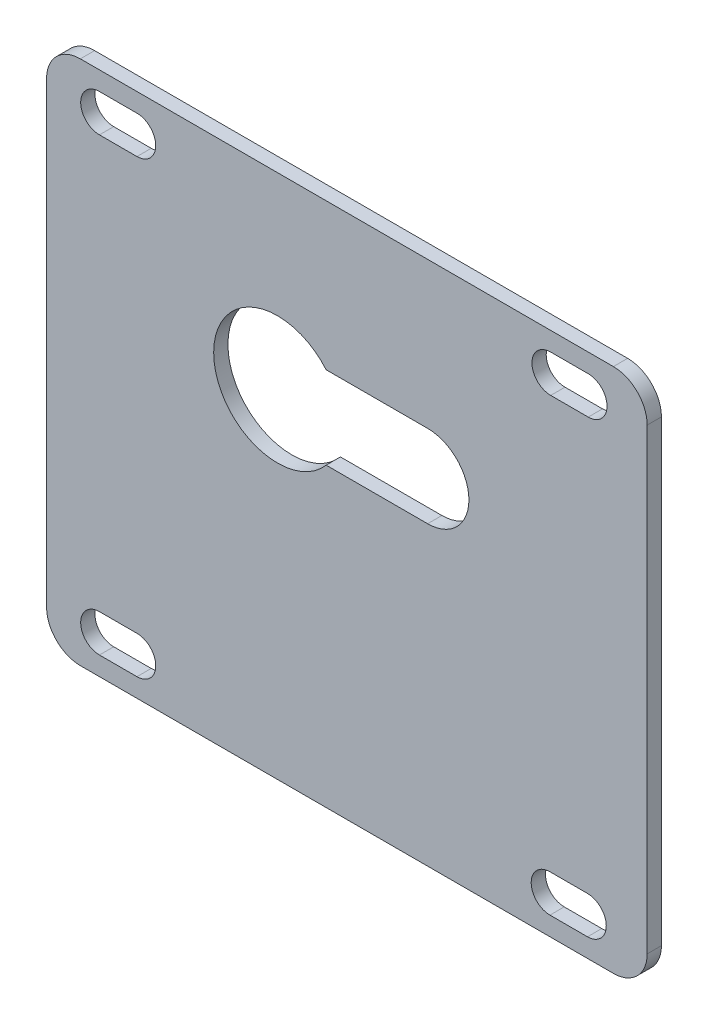
ISO-10303-21;
HEADER;
FILE_DESCRIPTION(('STEP AP214'),'2;1');
FILE_NAME('part.step','',(''),(''),'','','');
FILE_SCHEMA(('AUTOMOTIVE_DESIGN { 1 0 10303 214 1 1 1 1 }'));
ENDSEC;
DATA;
#1=APPLICATION_CONTEXT('core data for automotive mechanical design processes');
#2=APPLICATION_PROTOCOL_DEFINITION('international standard','automotive_design',2000,#1);
#3=PRODUCT_CONTEXT('',#1,'mechanical');
#4=PRODUCT('Part','Part','',(#3));
#5=PRODUCT_RELATED_PRODUCT_CATEGORY('part','',(#4));
#6=PRODUCT_DEFINITION_FORMATION('','',#4);
#7=PRODUCT_DEFINITION_CONTEXT('part definition',#1,'design');
#8=PRODUCT_DEFINITION('design','',#6,#7);
#9=PRODUCT_DEFINITION_SHAPE('','',#8);
#10=(LENGTH_UNIT() NAMED_UNIT(*) SI_UNIT(.MILLI.,.METRE.));
#11=(NAMED_UNIT(*) PLANE_ANGLE_UNIT() SI_UNIT($,.RADIAN.));
#12=(NAMED_UNIT(*) SI_UNIT($,.STERADIAN.) SOLID_ANGLE_UNIT());
#13=UNCERTAINTY_MEASURE_WITH_UNIT(LENGTH_MEASURE(1.E-05),#10,'distance_accuracy_value','');
#14=(GEOMETRIC_REPRESENTATION_CONTEXT(3) GLOBAL_UNCERTAINTY_ASSIGNED_CONTEXT((#13)) GLOBAL_UNIT_ASSIGNED_CONTEXT((#10,
#11,#12)) REPRESENTATION_CONTEXT('',''));
#15=CARTESIAN_POINT('',(0.,0.,0.));
#16=DIRECTION('',(0.,0.,1.));
#17=DIRECTION('',(1.,0.,0.));
#18=AXIS2_PLACEMENT_3D('',#15,#16,#17);
#19=CARTESIAN_POINT('',(34.7426702976824,20.5,-1.9));
#20=DIRECTION('',(0.,0.,-1.));
#21=DIRECTION('',(-1.,0.,0.));
#22=AXIS2_PLACEMENT_3D('',#19,#20,#21);
#23=PLANE('',#22);
#24=CARTESIAN_POINT('',(34.7426702976824,20.5,-1.9));
#25=DIRECTION('',(0.,0.,1.));
#26=DIRECTION('',(-1.,0.,0.));
#27=AXIS2_PLACEMENT_3D('',#24,#25,#26);
#28=CIRCLE('',#27,4.5);
#29=CARTESIAN_POINT('',(39.2426702976824,20.5,-1.9));
#30=VERTEX_POINT('',#29);
#31=CARTESIAN_POINT('',(34.7426702976824,25.,-1.9));
#32=VERTEX_POINT('',#31);
#33=EDGE_CURVE('E386',#30,#32,#28,.T.);
#34=ORIENTED_EDGE('',*,*,#33,.F.);
#35=DIRECTION('',(0.,1.,0.));
#36=VECTOR('',#35,1.);
#37=CARTESIAN_POINT('',(39.2426702976824,20.5,-1.9));
#38=LINE('',#37,#36);
#39=CARTESIAN_POINT('',(39.2426702976824,-40.5,-1.9));
#40=VERTEX_POINT('',#39);
#41=EDGE_CURVE('E408',#40,#30,#38,.T.);
#42=ORIENTED_EDGE('',*,*,#41,.F.);
#43=CARTESIAN_POINT('',(34.7426702976824,-40.5,-1.9));
#44=DIRECTION('',(0.,0.,1.));
#45=DIRECTION('',(1.,0.,0.));
#46=AXIS2_PLACEMENT_3D('',#43,#44,#45);
#47=CIRCLE('',#46,4.5);
#48=CARTESIAN_POINT('',(34.7426702976824,-45.,-1.9));
#49=VERTEX_POINT('',#48);
#50=EDGE_CURVE('E405',#49,#40,#47,.T.);
#51=ORIENTED_EDGE('',*,*,#50,.F.);
#52=DIRECTION('',(1.,0.,0.));
#53=VECTOR('',#52,1.);
#54=CARTESIAN_POINT('',(-36.2573297023176,-45.,-1.9));
#55=LINE('',#54,#53);
#56=CARTESIAN_POINT('',(-36.2573297023176,-45.,-1.9));
#57=VERTEX_POINT('',#56);
#58=EDGE_CURVE('E402',#57,#49,#55,.T.);
#59=ORIENTED_EDGE('',*,*,#58,.F.);
#60=CARTESIAN_POINT('',(-36.2573297023176,-40.5,-1.9));
#61=DIRECTION('',(0.,0.,1.));
#62=DIRECTION('',(1.,0.,0.));
#63=AXIS2_PLACEMENT_3D('',#60,#61,#62);
#64=CIRCLE('',#63,4.5);
#65=CARTESIAN_POINT('',(-40.7573297023176,-40.5,-1.9));
#66=VERTEX_POINT('',#65);
#67=EDGE_CURVE('E399',#66,#57,#64,.T.);
#68=ORIENTED_EDGE('',*,*,#67,.F.);
#69=DIRECTION('',(0.,-1.,0.));
#70=VECTOR('',#69,1.);
#71=CARTESIAN_POINT('',(-40.7573297023176,20.5,-1.9));
#72=LINE('',#71,#70);
#73=CARTESIAN_POINT('',(-40.7573297023176,20.5,-1.9));
#74=VERTEX_POINT('',#73);
#75=EDGE_CURVE('E396',#74,#66,#72,.T.);
#76=ORIENTED_EDGE('',*,*,#75,.F.);
#77=CARTESIAN_POINT('',(-36.2573297023176,20.5,-1.9));
#78=DIRECTION('',(0.,0.,1.));
#79=DIRECTION('',(1.,0.,0.));
#80=AXIS2_PLACEMENT_3D('',#77,#78,#79);
#81=CIRCLE('',#80,4.5);
#82=CARTESIAN_POINT('',(-36.2573297023176,25.,-1.9));
#83=VERTEX_POINT('',#82);
#84=EDGE_CURVE('E393',#83,#74,#81,.T.);
#85=ORIENTED_EDGE('',*,*,#84,.F.);
#86=DIRECTION('',(-1.,0.,0.));
#87=VECTOR('',#86,1.);
#88=CARTESIAN_POINT('',(-36.2573297023176,25.,-1.9));
#89=LINE('',#88,#87);
#90=EDGE_CURVE('E389',#32,#83,#89,.T.);
#91=ORIENTED_EDGE('',*,*,#90,.F.);
#92=EDGE_LOOP('',(#34,#42,#51,#59,#68,#76,#85,#91));
#93=FACE_BOUND('',#92,.T.);
#94=CARTESIAN_POINT('',(-33.7157381002378,20.,-1.9));
#95=DIRECTION('',(0.,0.,1.));
#96=DIRECTION('',(1.,0.,0.));
#97=AXIS2_PLACEMENT_3D('',#94,#95,#96);
#98=CIRCLE('',#97,2.5);
#99=CARTESIAN_POINT('',(-33.7157381002378,22.5,-1.9));
#100=VERTEX_POINT('',#99);
#101=CARTESIAN_POINT('',(-33.7157381002378,17.5,-1.9));
#102=VERTEX_POINT('',#101);
#103=EDGE_CURVE('E354',#100,#102,#98,.T.);
#104=ORIENTED_EDGE('',*,*,#103,.T.);
#105=DIRECTION('',(1.,0.,0.));
#106=VECTOR('',#105,1.);
#107=CARTESIAN_POINT('',(-33.7157381002378,17.5,-1.9));
#108=LINE('',#107,#106);
#109=CARTESIAN_POINT('',(-28.7157381002378,17.5,-1.9));
#110=VERTEX_POINT('',#109);
#111=EDGE_CURVE('E357',#102,#110,#108,.T.);
#112=ORIENTED_EDGE('',*,*,#111,.T.);
#113=CARTESIAN_POINT('',(-28.7157381002378,20.,-1.9));
#114=DIRECTION('',(0.,0.,1.));
#115=DIRECTION('',(1.,0.,0.));
#116=AXIS2_PLACEMENT_3D('',#113,#114,#115);
#117=CIRCLE('',#116,2.5);
#118=CARTESIAN_POINT('',(-28.7157381002378,22.5,-1.9));
#119=VERTEX_POINT('',#118);
#120=EDGE_CURVE('E361',#110,#119,#117,.T.);
#121=ORIENTED_EDGE('',*,*,#120,.T.);
#122=DIRECTION('',(-1.,0.,0.));
#123=VECTOR('',#122,1.);
#124=CARTESIAN_POINT('',(-33.7157381002378,22.5,-1.9));
#125=LINE('',#124,#123);
#126=EDGE_CURVE('E364',#119,#100,#125,.T.);
#127=ORIENTED_EDGE('',*,*,#126,.T.);
#128=EDGE_LOOP('',(#104,#112,#121,#127));
#129=FACE_BOUND('',#128,.T.);
#130=CARTESIAN_POINT('',(26.3941362381459,20.,-1.9));
#131=DIRECTION('',(0.,0.,1.));
#132=DIRECTION('',(1.,0.,0.));
#133=AXIS2_PLACEMENT_3D('',#130,#131,#132);
#134=CIRCLE('',#133,2.5);
#135=CARTESIAN_POINT('',(26.3941362381459,22.5,-1.9));
#136=VERTEX_POINT('',#135);
#137=CARTESIAN_POINT('',(26.3941362381459,17.5,-1.9));
#138=VERTEX_POINT('',#137);
#139=EDGE_CURVE('E322',#136,#138,#134,.T.);
#140=ORIENTED_EDGE('',*,*,#139,.T.);
#141=DIRECTION('',(1.,0.,0.));
#142=VECTOR('',#141,1.);
#143=CARTESIAN_POINT('',(26.3941362381459,17.5,-1.9));
#144=LINE('',#143,#142);
#145=CARTESIAN_POINT('',(31.3941362381459,17.5,-1.9));
#146=VERTEX_POINT('',#145);
#147=EDGE_CURVE('E325',#138,#146,#144,.T.);
#148=ORIENTED_EDGE('',*,*,#147,.T.);
#149=CARTESIAN_POINT('',(31.3941362381459,20.,-1.9));
#150=DIRECTION('',(0.,0.,1.));
#151=DIRECTION('',(1.,0.,0.));
#152=AXIS2_PLACEMENT_3D('',#149,#150,#151);
#153=CIRCLE('',#152,2.5);
#154=CARTESIAN_POINT('',(31.3941362381459,22.5,-1.9));
#155=VERTEX_POINT('',#154);
#156=EDGE_CURVE('E329',#146,#155,#153,.T.);
#157=ORIENTED_EDGE('',*,*,#156,.T.);
#158=DIRECTION('',(-1.,0.,0.));
#159=VECTOR('',#158,1.);
#160=CARTESIAN_POINT('',(26.3941362381459,22.5,-1.9));
#161=LINE('',#160,#159);
#162=EDGE_CURVE('E332',#155,#136,#161,.T.);
#163=ORIENTED_EDGE('',*,*,#162,.T.);
#164=EDGE_LOOP('',(#140,#148,#157,#163));
#165=FACE_BOUND('',#164,.T.);
#166=CARTESIAN_POINT('',(-33.7157381002378,-40.,-1.9));
#167=DIRECTION('',(0.,0.,1.));
#168=DIRECTION('',(1.,0.,0.));
#169=AXIS2_PLACEMENT_3D('',#166,#167,#168);
#170=CIRCLE('',#169,2.5);
#171=CARTESIAN_POINT('',(-33.7157381002378,-37.5,-1.9));
#172=VERTEX_POINT('',#171);
#173=CARTESIAN_POINT('',(-33.7157381002378,-42.5,-1.9));
#174=VERTEX_POINT('',#173);
#175=EDGE_CURVE('E290',#172,#174,#170,.T.);
#176=ORIENTED_EDGE('',*,*,#175,.T.);
#177=DIRECTION('',(1.,0.,0.));
#178=VECTOR('',#177,1.);
#179=CARTESIAN_POINT('',(-33.7157381002378,-42.5,-1.9));
#180=LINE('',#179,#178);
#181=CARTESIAN_POINT('',(-28.7157381002378,-42.5,-1.9));
#182=VERTEX_POINT('',#181);
#183=EDGE_CURVE('E293',#174,#182,#180,.T.);
#184=ORIENTED_EDGE('',*,*,#183,.T.);
#185=CARTESIAN_POINT('',(-28.7157381002378,-40.,-1.9));
#186=DIRECTION('',(0.,0.,1.));
#187=DIRECTION('',(1.,0.,0.));
#188=AXIS2_PLACEMENT_3D('',#185,#186,#187);
#189=CIRCLE('',#188,2.50000000000001);
#190=CARTESIAN_POINT('',(-28.7157381002378,-37.5,-1.9));
#191=VERTEX_POINT('',#190);
#192=EDGE_CURVE('E297',#182,#191,#189,.T.);
#193=ORIENTED_EDGE('',*,*,#192,.T.);
#194=DIRECTION('',(-1.,0.,0.));
#195=VECTOR('',#194,1.);
#196=CARTESIAN_POINT('',(-33.7157381002378,-37.5,-1.9));
#197=LINE('',#196,#195);
#198=EDGE_CURVE('E300',#191,#172,#197,.T.);
#199=ORIENTED_EDGE('',*,*,#198,.T.);
#200=EDGE_LOOP('',(#176,#184,#193,#199));
#201=FACE_BOUND('',#200,.T.);
#202=CARTESIAN_POINT('',(26.2942618997622,-40.,-1.9));
#203=DIRECTION('',(0.,0.,1.));
#204=DIRECTION('',(1.,0.,0.));
#205=AXIS2_PLACEMENT_3D('',#202,#203,#204);
#206=CIRCLE('',#205,2.5);
#207=CARTESIAN_POINT('',(26.2942618997622,-37.5,-1.9));
#208=VERTEX_POINT('',#207);
#209=CARTESIAN_POINT('',(26.2942618997622,-42.5,-1.9));
#210=VERTEX_POINT('',#209);
#211=EDGE_CURVE('E258',#208,#210,#206,.T.);
#212=ORIENTED_EDGE('',*,*,#211,.T.);
#213=DIRECTION('',(1.,0.,0.));
#214=VECTOR('',#213,1.);
#215=CARTESIAN_POINT('',(26.2942618997622,-42.5,-1.9));
#216=LINE('',#215,#214);
#217=CARTESIAN_POINT('',(31.2942618997622,-42.5,-1.9));
#218=VERTEX_POINT('',#217);
#219=EDGE_CURVE('E261',#210,#218,#216,.T.);
#220=ORIENTED_EDGE('',*,*,#219,.T.);
#221=CARTESIAN_POINT('',(31.2942618997622,-40.,-1.9));
#222=DIRECTION('',(0.,0.,1.));
#223=DIRECTION('',(1.,0.,0.));
#224=AXIS2_PLACEMENT_3D('',#221,#222,#223);
#225=CIRCLE('',#224,2.5);
#226=CARTESIAN_POINT('',(31.2942618997622,-37.5,-1.9));
#227=VERTEX_POINT('',#226);
#228=EDGE_CURVE('E265',#218,#227,#225,.T.);
#229=ORIENTED_EDGE('',*,*,#228,.T.);
#230=DIRECTION('',(-1.,0.,0.));
#231=VECTOR('',#230,1.);
#232=CARTESIAN_POINT('',(26.2942618997622,-37.5,-1.9));
#233=LINE('',#232,#231);
#234=EDGE_CURVE('E268',#227,#208,#233,.T.);
#235=ORIENTED_EDGE('',*,*,#234,.T.);
#236=EDGE_LOOP('',(#212,#220,#229,#235));
#237=FACE_BOUND('',#236,.T.);
#238=CARTESIAN_POINT('',(10.,0.,-1.9));
#239=DIRECTION('',(0.,0.,-1.));
#240=DIRECTION('',(-1.,0.,0.));
#241=AXIS2_PLACEMENT_3D('',#238,#239,#240);
#242=CIRCLE('',#241,5.5);
#243=CARTESIAN_POINT('',(10.,5.5,-1.9));
#244=VERTEX_POINT('',#243);
#245=CARTESIAN_POINT('',(10.,-5.5,-1.9));
#246=VERTEX_POINT('',#245);
#247=EDGE_CURVE('E252',#244,#246,#242,.T.);
#248=ORIENTED_EDGE('',*,*,#247,.F.);
#249=DIRECTION('',(-1.,0.,0.));
#250=VECTOR('',#249,1.);
#251=CARTESIAN_POINT('',(34.7426702976824,5.5,-1.9));
#252=LINE('',#251,#250);
#253=CARTESIAN_POINT('',(-3.51925930159214,5.5,-1.9));
#254=VERTEX_POINT('',#253);
#255=EDGE_CURVE('E254',#244,#254,#252,.T.);
#256=ORIENTED_EDGE('',*,*,#255,.T.);
#257=CARTESIAN_POINT('',(-10.,0.,-1.9));
#258=DIRECTION('',(0.,0.,-1.));
#259=DIRECTION('',(-1.,0.,0.));
#260=AXIS2_PLACEMENT_3D('',#257,#258,#259);
#261=CIRCLE('',#260,8.5);
#262=CARTESIAN_POINT('',(-3.51925930159214,-5.5,-1.9));
#263=VERTEX_POINT('',#262);
#264=EDGE_CURVE('E247',#263,#254,#261,.T.);
#265=ORIENTED_EDGE('',*,*,#264,.F.);
#266=DIRECTION('',(-1.,0.,0.));
#267=VECTOR('',#266,1.);
#268=CARTESIAN_POINT('',(34.7426702976824,-5.49999999999999,-1.9));
#269=LINE('',#268,#267);
#270=EDGE_CURVE('E228',#246,#263,#269,.T.);
#271=ORIENTED_EDGE('',*,*,#270,.F.);
#272=EDGE_LOOP('',(#248,#256,#265,#271));
#273=FACE_BOUND('',#272,.T.);
#274=ADVANCED_FACE('F36',(#93,#129,#165,#201,#237,#273),#23,.T.);
#275=CARTESIAN_POINT('',(34.7426702976824,20.5,0.));
#276=DIRECTION('',(0.,0.,-1.));
#277=DIRECTION('',(-1.,0.,0.));
#278=AXIS2_PLACEMENT_3D('',#275,#276,#277);
#279=PLANE('',#278);
#280=CARTESIAN_POINT('',(34.7426702976824,20.5,0.));
#281=DIRECTION('',(0.,0.,1.));
#282=DIRECTION('',(-1.,0.,0.));
#283=AXIS2_PLACEMENT_3D('',#280,#281,#282);
#284=CIRCLE('',#283,4.5);
#285=CARTESIAN_POINT('',(39.2426702976824,20.5,0.));
#286=VERTEX_POINT('',#285);
#287=CARTESIAN_POINT('',(34.7426702976824,25.,0.));
#288=VERTEX_POINT('',#287);
#289=EDGE_CURVE('E379',#286,#288,#284,.T.);
#290=ORIENTED_EDGE('',*,*,#289,.T.);
#291=DIRECTION('',(-1.,0.,0.));
#292=VECTOR('',#291,1.);
#293=CARTESIAN_POINT('',(-36.2573297023176,25.,0.));
#294=LINE('',#293,#292);
#295=CARTESIAN_POINT('',(-36.2573297023176,25.,0.));
#296=VERTEX_POINT('',#295);
#297=EDGE_CURVE('E413',#288,#296,#294,.T.);
#298=ORIENTED_EDGE('',*,*,#297,.T.);
#299=CARTESIAN_POINT('',(-36.2573297023176,20.5,0.));
#300=DIRECTION('',(0.,0.,1.));
#301=DIRECTION('',(1.,0.,0.));
#302=AXIS2_PLACEMENT_3D('',#299,#300,#301);
#303=CIRCLE('',#302,4.5);
#304=CARTESIAN_POINT('',(-40.7573297023176,20.5,0.));
#305=VERTEX_POINT('',#304);
#306=EDGE_CURVE('E416',#296,#305,#303,.T.);
#307=ORIENTED_EDGE('',*,*,#306,.T.);
#308=DIRECTION('',(0.,-1.,0.));
#309=VECTOR('',#308,1.);
#310=CARTESIAN_POINT('',(-40.7573297023176,20.5,0.));
#311=LINE('',#310,#309);
#312=CARTESIAN_POINT('',(-40.7573297023176,-40.5,0.));
#313=VERTEX_POINT('',#312);
#314=EDGE_CURVE('E419',#305,#313,#311,.T.);
#315=ORIENTED_EDGE('',*,*,#314,.T.);
#316=CARTESIAN_POINT('',(-36.2573297023176,-40.5,0.));
#317=DIRECTION('',(0.,0.,1.));
#318=DIRECTION('',(1.,0.,0.));
#319=AXIS2_PLACEMENT_3D('',#316,#317,#318);
#320=CIRCLE('',#319,4.5);
#321=CARTESIAN_POINT('',(-36.2573297023176,-45.,0.));
#322=VERTEX_POINT('',#321);
#323=EDGE_CURVE('E422',#313,#322,#320,.T.);
#324=ORIENTED_EDGE('',*,*,#323,.T.);
#325=DIRECTION('',(1.,0.,0.));
#326=VECTOR('',#325,1.);
#327=CARTESIAN_POINT('',(-36.2573297023176,-45.,0.));
#328=LINE('',#327,#326);
#329=CARTESIAN_POINT('',(34.7426702976824,-45.,0.));
#330=VERTEX_POINT('',#329);
#331=EDGE_CURVE('E425',#322,#330,#328,.T.);
#332=ORIENTED_EDGE('',*,*,#331,.T.);
#333=CARTESIAN_POINT('',(34.7426702976824,-40.5,0.));
#334=DIRECTION('',(0.,0.,1.));
#335=DIRECTION('',(1.,0.,0.));
#336=AXIS2_PLACEMENT_3D('',#333,#334,#335);
#337=CIRCLE('',#336,4.5);
#338=CARTESIAN_POINT('',(39.2426702976824,-40.5,0.));
#339=VERTEX_POINT('',#338);
#340=EDGE_CURVE('E428',#330,#339,#337,.T.);
#341=ORIENTED_EDGE('',*,*,#340,.T.);
#342=DIRECTION('',(0.,1.,0.));
#343=VECTOR('',#342,1.);
#344=CARTESIAN_POINT('',(39.2426702976824,20.5,0.));
#345=LINE('',#344,#343);
#346=EDGE_CURVE('E390',#339,#286,#345,.T.);
#347=ORIENTED_EDGE('',*,*,#346,.T.);
#348=EDGE_LOOP('',(#290,#298,#307,#315,#324,#332,#341,#347));
#349=FACE_BOUND('',#348,.T.);
#350=DIRECTION('',(1.,0.,0.));
#351=VECTOR('',#350,1.);
#352=CARTESIAN_POINT('',(-33.7157381002378,17.5,0.));
#353=LINE('',#352,#351);
#354=CARTESIAN_POINT('',(-33.7157381002378,17.5,0.));
#355=VERTEX_POINT('',#354);
#356=CARTESIAN_POINT('',(-28.7157381002378,17.5,0.));
#357=VERTEX_POINT('',#356);
#358=EDGE_CURVE('E369',#355,#357,#353,.T.);
#359=ORIENTED_EDGE('',*,*,#358,.F.);
#360=CARTESIAN_POINT('',(-33.7157381002378,20.,0.));
#361=DIRECTION('',(0.,0.,1.));
#362=DIRECTION('',(1.,0.,0.));
#363=AXIS2_PLACEMENT_3D('',#360,#361,#362);
#364=CIRCLE('',#363,2.5);
#365=CARTESIAN_POINT('',(-33.7157381002378,22.5,0.));
#366=VERTEX_POINT('',#365);
#367=EDGE_CURVE('E347',#366,#355,#364,.T.);
#368=ORIENTED_EDGE('',*,*,#367,.F.);
#369=DIRECTION('',(-1.,0.,0.));
#370=VECTOR('',#369,1.);
#371=CARTESIAN_POINT('',(-33.7157381002378,22.5,0.));
#372=LINE('',#371,#370);
#373=CARTESIAN_POINT('',(-28.7157381002378,22.5,0.));
#374=VERTEX_POINT('',#373);
#375=EDGE_CURVE('E358',#374,#366,#372,.T.);
#376=ORIENTED_EDGE('',*,*,#375,.F.);
#377=CARTESIAN_POINT('',(-28.7157381002378,20.,0.));
#378=DIRECTION('',(0.,0.,1.));
#379=DIRECTION('',(1.,0.,0.));
#380=AXIS2_PLACEMENT_3D('',#377,#378,#379);
#381=CIRCLE('',#380,2.5);
#382=EDGE_CURVE('E372',#357,#374,#381,.T.);
#383=ORIENTED_EDGE('',*,*,#382,.F.);
#384=EDGE_LOOP('',(#359,#368,#376,#383));
#385=FACE_BOUND('',#384,.T.);
#386=DIRECTION('',(1.,0.,0.));
#387=VECTOR('',#386,1.);
#388=CARTESIAN_POINT('',(26.3941362381459,17.5,0.));
#389=LINE('',#388,#387);
#390=CARTESIAN_POINT('',(26.3941362381459,17.5,0.));
#391=VERTEX_POINT('',#390);
#392=CARTESIAN_POINT('',(31.3941362381459,17.5,0.));
#393=VERTEX_POINT('',#392);
#394=EDGE_CURVE('E337',#391,#393,#389,.T.);
#395=ORIENTED_EDGE('',*,*,#394,.F.);
#396=CARTESIAN_POINT('',(26.3941362381459,20.,0.));
#397=DIRECTION('',(0.,0.,1.));
#398=DIRECTION('',(1.,0.,0.));
#399=AXIS2_PLACEMENT_3D('',#396,#397,#398);
#400=CIRCLE('',#399,2.5);
#401=CARTESIAN_POINT('',(26.3941362381459,22.5,0.));
#402=VERTEX_POINT('',#401);
#403=EDGE_CURVE('E315',#402,#391,#400,.T.);
#404=ORIENTED_EDGE('',*,*,#403,.F.);
#405=DIRECTION('',(-1.,0.,0.));
#406=VECTOR('',#405,1.);
#407=CARTESIAN_POINT('',(26.3941362381459,22.5,0.));
#408=LINE('',#407,#406);
#409=CARTESIAN_POINT('',(31.3941362381459,22.5,0.));
#410=VERTEX_POINT('',#409);
#411=EDGE_CURVE('E326',#410,#402,#408,.T.);
#412=ORIENTED_EDGE('',*,*,#411,.F.);
#413=CARTESIAN_POINT('',(31.3941362381459,20.,0.));
#414=DIRECTION('',(0.,0.,1.));
#415=DIRECTION('',(1.,0.,0.));
#416=AXIS2_PLACEMENT_3D('',#413,#414,#415);
#417=CIRCLE('',#416,2.5);
#418=EDGE_CURVE('E340',#393,#410,#417,.T.);
#419=ORIENTED_EDGE('',*,*,#418,.F.);
#420=EDGE_LOOP('',(#395,#404,#412,#419));
#421=FACE_BOUND('',#420,.T.);
#422=DIRECTION('',(1.,0.,0.));
#423=VECTOR('',#422,1.);
#424=CARTESIAN_POINT('',(-33.7157381002378,-42.5,0.));
#425=LINE('',#424,#423);
#426=CARTESIAN_POINT('',(-33.7157381002378,-42.5,0.));
#427=VERTEX_POINT('',#426);
#428=CARTESIAN_POINT('',(-28.7157381002378,-42.5,0.));
#429=VERTEX_POINT('',#428);
#430=EDGE_CURVE('E305',#427,#429,#425,.T.);
#431=ORIENTED_EDGE('',*,*,#430,.F.);
#432=CARTESIAN_POINT('',(-33.7157381002378,-40.,0.));
#433=DIRECTION('',(0.,0.,1.));
#434=DIRECTION('',(1.,0.,0.));
#435=AXIS2_PLACEMENT_3D('',#432,#433,#434);
#436=CIRCLE('',#435,2.5);
#437=CARTESIAN_POINT('',(-33.7157381002378,-37.5,0.));
#438=VERTEX_POINT('',#437);
#439=EDGE_CURVE('E283',#438,#427,#436,.T.);
#440=ORIENTED_EDGE('',*,*,#439,.F.);
#441=DIRECTION('',(-1.,0.,0.));
#442=VECTOR('',#441,1.);
#443=CARTESIAN_POINT('',(-33.7157381002378,-37.5,0.));
#444=LINE('',#443,#442);
#445=CARTESIAN_POINT('',(-28.7157381002378,-37.5,0.));
#446=VERTEX_POINT('',#445);
#447=EDGE_CURVE('E294',#446,#438,#444,.T.);
#448=ORIENTED_EDGE('',*,*,#447,.F.);
#449=CARTESIAN_POINT('',(-28.7157381002378,-40.,0.));
#450=DIRECTION('',(0.,0.,1.));
#451=DIRECTION('',(1.,0.,0.));
#452=AXIS2_PLACEMENT_3D('',#449,#450,#451);
#453=CIRCLE('',#452,2.50000000000001);
#454=EDGE_CURVE('E308',#429,#446,#453,.T.);
#455=ORIENTED_EDGE('',*,*,#454,.F.);
#456=EDGE_LOOP('',(#431,#440,#448,#455));
#457=FACE_BOUND('',#456,.T.);
#458=DIRECTION('',(1.,0.,0.));
#459=VECTOR('',#458,1.);
#460=CARTESIAN_POINT('',(26.2942618997622,-42.5,0.));
#461=LINE('',#460,#459);
#462=CARTESIAN_POINT('',(26.2942618997622,-42.5,0.));
#463=VERTEX_POINT('',#462);
#464=CARTESIAN_POINT('',(31.2942618997622,-42.5,0.));
#465=VERTEX_POINT('',#464);
#466=EDGE_CURVE('E273',#463,#465,#461,.T.);
#467=ORIENTED_EDGE('',*,*,#466,.F.);
#468=CARTESIAN_POINT('',(26.2942618997622,-40.,0.));
#469=DIRECTION('',(0.,0.,1.));
#470=DIRECTION('',(1.,0.,0.));
#471=AXIS2_PLACEMENT_3D('',#468,#469,#470);
#472=CIRCLE('',#471,2.5);
#473=CARTESIAN_POINT('',(26.2942618997622,-37.5,0.));
#474=VERTEX_POINT('',#473);
#475=EDGE_CURVE('E257',#474,#463,#472,.T.);
#476=ORIENTED_EDGE('',*,*,#475,.F.);
#477=DIRECTION('',(-1.,0.,0.));
#478=VECTOR('',#477,1.);
#479=CARTESIAN_POINT('',(26.2942618997622,-37.5,0.));
#480=LINE('',#479,#478);
#481=CARTESIAN_POINT('',(31.2942618997622,-37.5,0.));
#482=VERTEX_POINT('',#481);
#483=EDGE_CURVE('E262',#482,#474,#480,.T.);
#484=ORIENTED_EDGE('',*,*,#483,.F.);
#485=CARTESIAN_POINT('',(31.2942618997622,-40.,0.));
#486=DIRECTION('',(0.,0.,1.));
#487=DIRECTION('',(1.,0.,0.));
#488=AXIS2_PLACEMENT_3D('',#485,#486,#487);
#489=CIRCLE('',#488,2.5);
#490=EDGE_CURVE('E276',#465,#482,#489,.T.);
#491=ORIENTED_EDGE('',*,*,#490,.F.);
#492=EDGE_LOOP('',(#467,#476,#484,#491));
#493=FACE_BOUND('',#492,.T.);
#494=DIRECTION('',(1.,0.,0.));
#495=VECTOR('',#494,1.);
#496=CARTESIAN_POINT('',(0.,5.5,0.));
#497=LINE('',#496,#495);
#498=CARTESIAN_POINT('',(-3.51925930159214,5.5,0.));
#499=VERTEX_POINT('',#498);
#500=CARTESIAN_POINT('',(10.,5.5,0.));
#501=VERTEX_POINT('',#500);
#502=EDGE_CURVE('E61',#499,#501,#497,.T.);
#503=ORIENTED_EDGE('',*,*,#502,.T.);
#504=CARTESIAN_POINT('',(10.,0.,0.));
#505=DIRECTION('',(0.,0.,1.));
#506=DIRECTION('',(1.,0.,0.));
#507=AXIS2_PLACEMENT_3D('',#504,#505,#506);
#508=CIRCLE('',#507,5.5);
#509=CARTESIAN_POINT('',(10.,-5.5,0.));
#510=VERTEX_POINT('',#509);
#511=EDGE_CURVE('E240',#510,#501,#508,.T.);
#512=ORIENTED_EDGE('',*,*,#511,.F.);
#513=DIRECTION('',(1.,0.,0.));
#514=VECTOR('',#513,1.);
#515=CARTESIAN_POINT('',(0.,-5.5,0.));
#516=LINE('',#515,#514);
#517=CARTESIAN_POINT('',(-3.51925930159214,-5.5,0.));
#518=VERTEX_POINT('',#517);
#519=EDGE_CURVE('E225',#518,#510,#516,.T.);
#520=ORIENTED_EDGE('',*,*,#519,.F.);
#521=CARTESIAN_POINT('',(-10.,0.,0.));
#522=DIRECTION('',(0.,0.,1.));
#523=DIRECTION('',(1.,0.,0.));
#524=AXIS2_PLACEMENT_3D('',#521,#522,#523);
#525=CIRCLE('',#524,8.5);
#526=EDGE_CURVE('E234',#499,#518,#525,.T.);
#527=ORIENTED_EDGE('',*,*,#526,.F.);
#528=EDGE_LOOP('',(#503,#512,#520,#527));
#529=FACE_BOUND('',#528,.T.);
#530=ADVANCED_FACE('F238',(#349,#385,#421,#457,#493,#529),#279,.F.);
#531=CARTESIAN_POINT('',(34.7426702976824,20.5,-1.9));
#532=DIRECTION('',(0.,0.,1.));
#533=DIRECTION('',(1.,0.,0.));
#534=AXIS2_PLACEMENT_3D('',#531,#532,#533);
#535=CYLINDRICAL_SURFACE('',#534,4.5);
#536=ORIENTED_EDGE('',*,*,#289,.F.);
#537=DIRECTION('',(0.,0.,1.));
#538=VECTOR('',#537,1.);
#539=CARTESIAN_POINT('',(39.2426702976824,20.5,-1.9));
#540=LINE('',#539,#538);
#541=EDGE_CURVE('E11',#30,#286,#540,.T.);
#542=ORIENTED_EDGE('',*,*,#541,.F.);
#543=ORIENTED_EDGE('',*,*,#33,.T.);
#544=DIRECTION('',(0.,0.,1.));
#545=VECTOR('',#544,1.);
#546=CARTESIAN_POINT('',(34.7426702976824,25.,-1.9));
#547=LINE('',#546,#545);
#548=EDGE_CURVE('E40',#32,#288,#547,.T.);
#549=ORIENTED_EDGE('',*,*,#548,.T.);
#550=EDGE_LOOP('',(#536,#542,#543,#549));
#551=FACE_BOUND('',#550,.T.);
#552=ADVANCED_FACE('F38',(#551),#535,.T.);
#553=CARTESIAN_POINT('',(39.2426702976824,20.5,-1.9));
#554=DIRECTION('',(1.,0.,0.));
#555=DIRECTION('',(0.,1.,0.));
#556=AXIS2_PLACEMENT_3D('',#553,#554,#555);
#557=PLANE('',#556);
#558=ORIENTED_EDGE('',*,*,#346,.F.);
#559=DIRECTION('',(0.,0.,1.));
#560=VECTOR('',#559,1.);
#561=CARTESIAN_POINT('',(39.2426702976824,-40.5,-1.9));
#562=LINE('',#561,#560);
#563=EDGE_CURVE('E45',#40,#339,#562,.T.);
#564=ORIENTED_EDGE('',*,*,#563,.F.);
#565=ORIENTED_EDGE('',*,*,#41,.T.);
#566=ORIENTED_EDGE('',*,*,#541,.T.);
#567=EDGE_LOOP('',(#558,#564,#565,#566));
#568=FACE_BOUND('',#567,.T.);
#569=ADVANCED_FACE('F455',(#568),#557,.T.);
#570=CARTESIAN_POINT('',(34.7426702976824,-40.5,-1.9));
#571=DIRECTION('',(0.,0.,1.));
#572=DIRECTION('',(1.,0.,0.));
#573=AXIS2_PLACEMENT_3D('',#570,#571,#572);
#574=CYLINDRICAL_SURFACE('',#573,4.5);
#575=ORIENTED_EDGE('',*,*,#340,.F.);
#576=DIRECTION('',(0.,0.,1.));
#577=VECTOR('',#576,1.);
#578=CARTESIAN_POINT('',(34.7426702976824,-45.,-1.9));
#579=LINE('',#578,#577);
#580=EDGE_CURVE('E434',#49,#330,#579,.T.);
#581=ORIENTED_EDGE('',*,*,#580,.F.);
#582=ORIENTED_EDGE('',*,*,#50,.T.);
#583=ORIENTED_EDGE('',*,*,#563,.T.);
#584=EDGE_LOOP('',(#575,#581,#582,#583));
#585=FACE_BOUND('',#584,.T.);
#586=ADVANCED_FACE('F476',(#585),#574,.T.);
#587=CARTESIAN_POINT('',(-36.2573297023176,-45.,-1.9));
#588=DIRECTION('',(0.,-1.,0.));
#589=DIRECTION('',(0.,0.,-1.));
#590=AXIS2_PLACEMENT_3D('',#587,#588,#589);
#591=PLANE('',#590);
#592=ORIENTED_EDGE('',*,*,#331,.F.);
#593=DIRECTION('',(0.,0.,1.));
#594=VECTOR('',#593,1.);
#595=CARTESIAN_POINT('',(-36.2573297023176,-45.,-1.9));
#596=LINE('',#595,#594);
#597=EDGE_CURVE('E436',#57,#322,#596,.T.);
#598=ORIENTED_EDGE('',*,*,#597,.F.);
#599=ORIENTED_EDGE('',*,*,#58,.T.);
#600=ORIENTED_EDGE('',*,*,#580,.T.);
#601=EDGE_LOOP('',(#592,#598,#599,#600));
#602=FACE_BOUND('',#601,.T.);
#603=ADVANCED_FACE('F474',(#602),#591,.T.);
#604=CARTESIAN_POINT('',(-36.2573297023176,-40.5,-1.9));
#605=DIRECTION('',(0.,0.,1.));
#606=DIRECTION('',(1.,0.,0.));
#607=AXIS2_PLACEMENT_3D('',#604,#605,#606);
#608=CYLINDRICAL_SURFACE('',#607,4.5);
#609=ORIENTED_EDGE('',*,*,#323,.F.);
#610=DIRECTION('',(0.,0.,1.));
#611=VECTOR('',#610,1.);
#612=CARTESIAN_POINT('',(-40.7573297023176,-40.5,-1.9));
#613=LINE('',#612,#611);
#614=EDGE_CURVE('E438',#66,#313,#613,.T.);
#615=ORIENTED_EDGE('',*,*,#614,.F.);
#616=ORIENTED_EDGE('',*,*,#67,.T.);
#617=ORIENTED_EDGE('',*,*,#597,.T.);
#618=EDGE_LOOP('',(#609,#615,#616,#617));
#619=FACE_BOUND('',#618,.T.);
#620=ADVANCED_FACE('F470',(#619),#608,.T.);
#621=CARTESIAN_POINT('',(-40.7573297023176,20.5,-1.9));
#622=DIRECTION('',(-1.,0.,0.));
#623=DIRECTION('',(0.,-1.,0.));
#624=AXIS2_PLACEMENT_3D('',#621,#622,#623);
#625=PLANE('',#624);
#626=ORIENTED_EDGE('',*,*,#314,.F.);
#627=DIRECTION('',(0.,0.,1.));
#628=VECTOR('',#627,1.);
#629=CARTESIAN_POINT('',(-40.7573297023176,20.5,-1.9));
#630=LINE('',#629,#628);
#631=EDGE_CURVE('E440',#74,#305,#630,.T.);
#632=ORIENTED_EDGE('',*,*,#631,.F.);
#633=ORIENTED_EDGE('',*,*,#75,.T.);
#634=ORIENTED_EDGE('',*,*,#614,.T.);
#635=EDGE_LOOP('',(#626,#632,#633,#634));
#636=FACE_BOUND('',#635,.T.);
#637=ADVANCED_FACE('F468',(#636),#625,.T.);
#638=CARTESIAN_POINT('',(-36.2573297023176,20.5,-1.9));
#639=DIRECTION('',(0.,0.,1.));
#640=DIRECTION('',(1.,0.,0.));
#641=AXIS2_PLACEMENT_3D('',#638,#639,#640);
#642=CYLINDRICAL_SURFACE('',#641,4.5);
#643=ORIENTED_EDGE('',*,*,#306,.F.);
#644=DIRECTION('',(0.,0.,1.));
#645=VECTOR('',#644,1.);
#646=CARTESIAN_POINT('',(-36.2573297023176,25.,-1.9));
#647=LINE('',#646,#645);
#648=EDGE_CURVE('E441',#83,#296,#647,.T.);
#649=ORIENTED_EDGE('',*,*,#648,.F.);
#650=ORIENTED_EDGE('',*,*,#84,.T.);
#651=ORIENTED_EDGE('',*,*,#631,.T.);
#652=EDGE_LOOP('',(#643,#649,#650,#651));
#653=FACE_BOUND('',#652,.T.);
#654=ADVANCED_FACE('F464',(#653),#642,.T.);
#655=CARTESIAN_POINT('',(-36.2573297023176,25.,-1.9));
#656=DIRECTION('',(0.,1.,0.));
#657=DIRECTION('',(0.,0.,1.));
#658=AXIS2_PLACEMENT_3D('',#655,#656,#657);
#659=PLANE('',#658);
#660=ORIENTED_EDGE('',*,*,#297,.F.);
#661=ORIENTED_EDGE('',*,*,#548,.F.);
#662=ORIENTED_EDGE('',*,*,#90,.T.);
#663=ORIENTED_EDGE('',*,*,#648,.T.);
#664=EDGE_LOOP('',(#660,#661,#662,#663));
#665=FACE_BOUND('',#664,.T.);
#666=ADVANCED_FACE('F449',(#665),#659,.T.);
#667=CARTESIAN_POINT('',(-33.7157381002378,20.,-1.9));
#668=DIRECTION('',(0.,0.,1.));
#669=DIRECTION('',(1.,0.,0.));
#670=AXIS2_PLACEMENT_3D('',#667,#668,#669);
#671=CYLINDRICAL_SURFACE('',#670,2.5);
#672=ORIENTED_EDGE('',*,*,#367,.T.);
#673=DIRECTION('',(0.,0.,1.));
#674=VECTOR('',#673,1.);
#675=CARTESIAN_POINT('',(-33.7157381002378,17.5,-1.9));
#676=LINE('',#675,#674);
#677=EDGE_CURVE('E367',#102,#355,#676,.T.);
#678=ORIENTED_EDGE('',*,*,#677,.F.);
#679=ORIENTED_EDGE('',*,*,#103,.F.);
#680=DIRECTION('',(0.,0.,1.));
#681=VECTOR('',#680,1.);
#682=CARTESIAN_POINT('',(-33.7157381002378,22.5,-1.9));
#683=LINE('',#682,#681);
#684=EDGE_CURVE('E377',#100,#366,#683,.T.);
#685=ORIENTED_EDGE('',*,*,#684,.T.);
#686=EDGE_LOOP('',(#672,#678,#679,#685));
#687=FACE_BOUND('',#686,.T.);
#688=ADVANCED_FACE('F492',(#687),#671,.F.);
#689=CARTESIAN_POINT('',(-33.7157381002378,22.5,-1.9));
#690=DIRECTION('',(0.,1.,0.));
#691=DIRECTION('',(0.,0.,1.));
#692=AXIS2_PLACEMENT_3D('',#689,#690,#691);
#693=PLANE('',#692);
#694=ORIENTED_EDGE('',*,*,#375,.T.);
#695=ORIENTED_EDGE('',*,*,#684,.F.);
#696=ORIENTED_EDGE('',*,*,#126,.F.);
#697=DIRECTION('',(0.,0.,1.));
#698=VECTOR('',#697,1.);
#699=CARTESIAN_POINT('',(-28.7157381002378,22.5,-1.9));
#700=LINE('',#699,#698);
#701=EDGE_CURVE('E380',#119,#374,#700,.T.);
#702=ORIENTED_EDGE('',*,*,#701,.T.);
#703=EDGE_LOOP('',(#694,#695,#696,#702));
#704=FACE_BOUND('',#703,.T.);
#705=ADVANCED_FACE('F495',(#704),#693,.F.);
#706=CARTESIAN_POINT('',(-28.7157381002378,20.,-1.9));
#707=DIRECTION('',(0.,0.,1.));
#708=DIRECTION('',(1.,0.,0.));
#709=AXIS2_PLACEMENT_3D('',#706,#707,#708);
#710=CYLINDRICAL_SURFACE('',#709,2.5);
#711=ORIENTED_EDGE('',*,*,#382,.T.);
#712=ORIENTED_EDGE('',*,*,#701,.F.);
#713=ORIENTED_EDGE('',*,*,#120,.F.);
#714=DIRECTION('',(0.,0.,1.));
#715=VECTOR('',#714,1.);
#716=CARTESIAN_POINT('',(-28.7157381002378,17.5,-1.9));
#717=LINE('',#716,#715);
#718=EDGE_CURVE('E382',#110,#357,#717,.T.);
#719=ORIENTED_EDGE('',*,*,#718,.T.);
#720=EDGE_LOOP('',(#711,#712,#713,#719));
#721=FACE_BOUND('',#720,.T.);
#722=ADVANCED_FACE('F501',(#721),#710,.F.);
#723=CARTESIAN_POINT('',(-33.7157381002378,17.5,-1.9));
#724=DIRECTION('',(0.,-1.,0.));
#725=DIRECTION('',(0.,0.,-1.));
#726=AXIS2_PLACEMENT_3D('',#723,#724,#725);
#727=PLANE('',#726);
#728=ORIENTED_EDGE('',*,*,#358,.T.);
#729=ORIENTED_EDGE('',*,*,#718,.F.);
#730=ORIENTED_EDGE('',*,*,#111,.F.);
#731=ORIENTED_EDGE('',*,*,#677,.T.);
#732=EDGE_LOOP('',(#728,#729,#730,#731));
#733=FACE_BOUND('',#732,.T.);
#734=ADVANCED_FACE('F497',(#733),#727,.F.);
#735=CARTESIAN_POINT('',(26.3941362381459,20.,-1.9));
#736=DIRECTION('',(0.,0.,1.));
#737=DIRECTION('',(1.,0.,0.));
#738=AXIS2_PLACEMENT_3D('',#735,#736,#737);
#739=CYLINDRICAL_SURFACE('',#738,2.5);
#740=ORIENTED_EDGE('',*,*,#403,.T.);
#741=DIRECTION('',(0.,0.,1.));
#742=VECTOR('',#741,1.);
#743=CARTESIAN_POINT('',(26.3941362381459,17.5,-1.9));
#744=LINE('',#743,#742);
#745=EDGE_CURVE('E335',#138,#391,#744,.T.);
#746=ORIENTED_EDGE('',*,*,#745,.F.);
#747=ORIENTED_EDGE('',*,*,#139,.F.);
#748=DIRECTION('',(0.,0.,1.));
#749=VECTOR('',#748,1.);
#750=CARTESIAN_POINT('',(26.3941362381459,22.5,-1.9));
#751=LINE('',#750,#749);
#752=EDGE_CURVE('E345',#136,#402,#751,.T.);
#753=ORIENTED_EDGE('',*,*,#752,.T.);
#754=EDGE_LOOP('',(#740,#746,#747,#753));
#755=FACE_BOUND('',#754,.T.);
#756=ADVANCED_FACE('F500',(#755),#739,.F.);
#757=CARTESIAN_POINT('',(26.3941362381459,22.5,-1.9));
#758=DIRECTION('',(0.,1.,0.));
#759=DIRECTION('',(-1.,0.,0.));
#760=AXIS2_PLACEMENT_3D('',#757,#758,#759);
#761=PLANE('',#760);
#762=ORIENTED_EDGE('',*,*,#411,.T.);
#763=ORIENTED_EDGE('',*,*,#752,.F.);
#764=ORIENTED_EDGE('',*,*,#162,.F.);
#765=DIRECTION('',(0.,0.,1.));
#766=VECTOR('',#765,1.);
#767=CARTESIAN_POINT('',(31.3941362381459,22.5,-1.9));
#768=LINE('',#767,#766);
#769=EDGE_CURVE('E348',#155,#410,#768,.T.);
#770=ORIENTED_EDGE('',*,*,#769,.T.);
#771=EDGE_LOOP('',(#762,#763,#764,#770));
#772=FACE_BOUND('',#771,.T.);
#773=ADVANCED_FACE('F511',(#772),#761,.F.);
#774=CARTESIAN_POINT('',(31.3941362381459,20.,-1.9));
#775=DIRECTION('',(0.,0.,1.));
#776=DIRECTION('',(1.,0.,0.));
#777=AXIS2_PLACEMENT_3D('',#774,#775,#776);
#778=CYLINDRICAL_SURFACE('',#777,2.5);
#779=ORIENTED_EDGE('',*,*,#418,.T.);
#780=ORIENTED_EDGE('',*,*,#769,.F.);
#781=ORIENTED_EDGE('',*,*,#156,.F.);
#782=DIRECTION('',(0.,0.,1.));
#783=VECTOR('',#782,1.);
#784=CARTESIAN_POINT('',(31.3941362381459,17.5,-1.9));
#785=LINE('',#784,#783);
#786=EDGE_CURVE('E350',#146,#393,#785,.T.);
#787=ORIENTED_EDGE('',*,*,#786,.T.);
#788=EDGE_LOOP('',(#779,#780,#781,#787));
#789=FACE_BOUND('',#788,.T.);
#790=ADVANCED_FACE('F517',(#789),#778,.F.);
#791=CARTESIAN_POINT('',(26.3941362381459,17.5,-1.9));
#792=DIRECTION('',(0.,-1.,0.));
#793=DIRECTION('',(1.,0.,0.));
#794=AXIS2_PLACEMENT_3D('',#791,#792,#793);
#795=PLANE('',#794);
#796=ORIENTED_EDGE('',*,*,#394,.T.);
#797=ORIENTED_EDGE('',*,*,#786,.F.);
#798=ORIENTED_EDGE('',*,*,#147,.F.);
#799=ORIENTED_EDGE('',*,*,#745,.T.);
#800=EDGE_LOOP('',(#796,#797,#798,#799));
#801=FACE_BOUND('',#800,.T.);
#802=ADVANCED_FACE('F513',(#801),#795,.F.);
#803=CARTESIAN_POINT('',(-33.7157381002378,-40.,-1.9));
#804=DIRECTION('',(0.,0.,1.));
#805=DIRECTION('',(1.,0.,0.));
#806=AXIS2_PLACEMENT_3D('',#803,#804,#805);
#807=CYLINDRICAL_SURFACE('',#806,2.5);
#808=ORIENTED_EDGE('',*,*,#439,.T.);
#809=DIRECTION('',(0.,0.,1.));
#810=VECTOR('',#809,1.);
#811=CARTESIAN_POINT('',(-33.7157381002378,-42.5,-1.9));
#812=LINE('',#811,#810);
#813=EDGE_CURVE('E303',#174,#427,#812,.T.);
#814=ORIENTED_EDGE('',*,*,#813,.F.);
#815=ORIENTED_EDGE('',*,*,#175,.F.);
#816=DIRECTION('',(0.,0.,1.));
#817=VECTOR('',#816,1.);
#818=CARTESIAN_POINT('',(-33.7157381002378,-37.5,-1.9));
#819=LINE('',#818,#817);
#820=EDGE_CURVE('E313',#172,#438,#819,.T.);
#821=ORIENTED_EDGE('',*,*,#820,.T.);
#822=EDGE_LOOP('',(#808,#814,#815,#821));
#823=FACE_BOUND('',#822,.T.);
#824=ADVANCED_FACE('F516',(#823),#807,.F.);
#825=CARTESIAN_POINT('',(-33.7157381002378,-37.5,-1.9));
#826=DIRECTION('',(0.,1.,0.));
#827=DIRECTION('',(-1.,0.,0.));
#828=AXIS2_PLACEMENT_3D('',#825,#826,#827);
#829=PLANE('',#828);
#830=ORIENTED_EDGE('',*,*,#447,.T.);
#831=ORIENTED_EDGE('',*,*,#820,.F.);
#832=ORIENTED_EDGE('',*,*,#198,.F.);
#833=DIRECTION('',(0.,0.,1.));
#834=VECTOR('',#833,1.);
#835=CARTESIAN_POINT('',(-28.7157381002378,-37.5,-1.9));
#836=LINE('',#835,#834);
#837=EDGE_CURVE('E316',#191,#446,#836,.T.);
#838=ORIENTED_EDGE('',*,*,#837,.T.);
#839=EDGE_LOOP('',(#830,#831,#832,#838));
#840=FACE_BOUND('',#839,.T.);
#841=ADVANCED_FACE('F527',(#840),#829,.F.);
#842=CARTESIAN_POINT('',(-28.7157381002378,-40.,-1.9));
#843=DIRECTION('',(0.,0.,1.));
#844=DIRECTION('',(1.,0.,0.));
#845=AXIS2_PLACEMENT_3D('',#842,#843,#844);
#846=CYLINDRICAL_SURFACE('',#845,2.50000000000001);
#847=ORIENTED_EDGE('',*,*,#454,.T.);
#848=ORIENTED_EDGE('',*,*,#837,.F.);
#849=ORIENTED_EDGE('',*,*,#192,.F.);
#850=DIRECTION('',(0.,0.,1.));
#851=VECTOR('',#850,1.);
#852=CARTESIAN_POINT('',(-28.7157381002378,-42.5,-1.9));
#853=LINE('',#852,#851);
#854=EDGE_CURVE('E318',#182,#429,#853,.T.);
#855=ORIENTED_EDGE('',*,*,#854,.T.);
#856=EDGE_LOOP('',(#847,#848,#849,#855));
#857=FACE_BOUND('',#856,.T.);
#858=ADVANCED_FACE('F533',(#857),#846,.F.);
#859=CARTESIAN_POINT('',(-33.7157381002378,-42.5,-1.9));
#860=DIRECTION('',(0.,-1.,0.));
#861=DIRECTION('',(1.,0.,0.));
#862=AXIS2_PLACEMENT_3D('',#859,#860,#861);
#863=PLANE('',#862);
#864=ORIENTED_EDGE('',*,*,#430,.T.);
#865=ORIENTED_EDGE('',*,*,#854,.F.);
#866=ORIENTED_EDGE('',*,*,#183,.F.);
#867=ORIENTED_EDGE('',*,*,#813,.T.);
#868=EDGE_LOOP('',(#864,#865,#866,#867));
#869=FACE_BOUND('',#868,.T.);
#870=ADVANCED_FACE('F529',(#869),#863,.F.);
#871=CARTESIAN_POINT('',(26.2942618997622,-40.,-1.9));
#872=DIRECTION('',(0.,0.,1.));
#873=DIRECTION('',(1.,0.,0.));
#874=AXIS2_PLACEMENT_3D('',#871,#872,#873);
#875=CYLINDRICAL_SURFACE('',#874,2.5);
#876=ORIENTED_EDGE('',*,*,#475,.T.);
#877=DIRECTION('',(0.,0.,1.));
#878=VECTOR('',#877,1.);
#879=CARTESIAN_POINT('',(26.2942618997622,-42.5,-1.9));
#880=LINE('',#879,#878);
#881=EDGE_CURVE('E271',#210,#463,#880,.T.);
#882=ORIENTED_EDGE('',*,*,#881,.F.);
#883=ORIENTED_EDGE('',*,*,#211,.F.);
#884=DIRECTION('',(0.,0.,1.));
#885=VECTOR('',#884,1.);
#886=CARTESIAN_POINT('',(26.2942618997622,-37.5,-1.9));
#887=LINE('',#886,#885);
#888=EDGE_CURVE('E281',#208,#474,#887,.T.);
#889=ORIENTED_EDGE('',*,*,#888,.T.);
#890=EDGE_LOOP('',(#876,#882,#883,#889));
#891=FACE_BOUND('',#890,.T.);
#892=ADVANCED_FACE('F532',(#891),#875,.F.);
#893=CARTESIAN_POINT('',(26.2942618997622,-37.5,-1.9));
#894=DIRECTION('',(0.,1.,0.));
#895=DIRECTION('',(0.,0.,1.));
#896=AXIS2_PLACEMENT_3D('',#893,#894,#895);
#897=PLANE('',#896);
#898=ORIENTED_EDGE('',*,*,#483,.T.);
#899=ORIENTED_EDGE('',*,*,#888,.F.);
#900=ORIENTED_EDGE('',*,*,#234,.F.);
#901=DIRECTION('',(0.,0.,1.));
#902=VECTOR('',#901,1.);
#903=CARTESIAN_POINT('',(31.2942618997622,-37.5,-1.9));
#904=LINE('',#903,#902);
#905=EDGE_CURVE('E284',#227,#482,#904,.T.);
#906=ORIENTED_EDGE('',*,*,#905,.T.);
#907=EDGE_LOOP('',(#898,#899,#900,#906));
#908=FACE_BOUND('',#907,.T.);
#909=ADVANCED_FACE('F543',(#908),#897,.F.);
#910=CARTESIAN_POINT('',(31.2942618997622,-40.,-1.9));
#911=DIRECTION('',(0.,0.,1.));
#912=DIRECTION('',(1.,0.,0.));
#913=AXIS2_PLACEMENT_3D('',#910,#911,#912);
#914=CYLINDRICAL_SURFACE('',#913,2.5);
#915=ORIENTED_EDGE('',*,*,#490,.T.);
#916=ORIENTED_EDGE('',*,*,#905,.F.);
#917=ORIENTED_EDGE('',*,*,#228,.F.);
#918=DIRECTION('',(0.,0.,1.));
#919=VECTOR('',#918,1.);
#920=CARTESIAN_POINT('',(31.2942618997622,-42.5,-1.9));
#921=LINE('',#920,#919);
#922=EDGE_CURVE('E286',#218,#465,#921,.T.);
#923=ORIENTED_EDGE('',*,*,#922,.T.);
#924=EDGE_LOOP('',(#915,#916,#917,#923));
#925=FACE_BOUND('',#924,.T.);
#926=ADVANCED_FACE('F549',(#925),#914,.F.);
#927=CARTESIAN_POINT('',(26.2942618997622,-42.5,-1.9));
#928=DIRECTION('',(0.,-1.,0.));
#929=DIRECTION('',(0.,0.,-1.));
#930=AXIS2_PLACEMENT_3D('',#927,#928,#929);
#931=PLANE('',#930);
#932=ORIENTED_EDGE('',*,*,#466,.T.);
#933=ORIENTED_EDGE('',*,*,#922,.F.);
#934=ORIENTED_EDGE('',*,*,#219,.F.);
#935=ORIENTED_EDGE('',*,*,#881,.T.);
#936=EDGE_LOOP('',(#932,#933,#934,#935));
#937=FACE_BOUND('',#936,.T.);
#938=ADVANCED_FACE('F545',(#937),#931,.F.);
#939=CARTESIAN_POINT('',(0.,5.5,-10.));
#940=DIRECTION('',(0.,-1.,0.));
#941=DIRECTION('',(0.,0.,-1.));
#942=AXIS2_PLACEMENT_3D('',#939,#940,#941);
#943=PLANE('',#942);
#944=DIRECTION('',(0.,0.,1.));
#945=VECTOR('',#944,1.);
#946=CARTESIAN_POINT('',(10.,5.5,-10.));
#947=LINE('',#946,#945);
#948=EDGE_CURVE('E245',#244,#501,#947,.T.);
#949=ORIENTED_EDGE('',*,*,#948,.T.);
#950=ORIENTED_EDGE('',*,*,#502,.F.);
#951=DIRECTION('',(0.,0.,1.));
#952=VECTOR('',#951,1.);
#953=CARTESIAN_POINT('',(-3.51925930159214,5.5,-10.));
#954=LINE('',#953,#952);
#955=EDGE_CURVE('E231',#254,#499,#954,.T.);
#956=ORIENTED_EDGE('',*,*,#955,.F.);
#957=ORIENTED_EDGE('',*,*,#255,.F.);
#958=EDGE_LOOP('',(#949,#950,#956,#957));
#959=FACE_BOUND('',#958,.T.);
#960=ADVANCED_FACE('F548',(#959),#943,.T.);
#961=CARTESIAN_POINT('',(10.,0.,-10.));
#962=DIRECTION('',(0.,0.,1.));
#963=DIRECTION('',(1.,0.,0.));
#964=AXIS2_PLACEMENT_3D('',#961,#962,#963);
#965=CYLINDRICAL_SURFACE('',#964,5.5);
#966=ORIENTED_EDGE('',*,*,#247,.T.);
#967=DIRECTION('',(0.,0.,1.));
#968=VECTOR('',#967,1.);
#969=CARTESIAN_POINT('',(10.,-5.5,-10.));
#970=LINE('',#969,#968);
#971=EDGE_CURVE('E230',#246,#510,#970,.T.);
#972=ORIENTED_EDGE('',*,*,#971,.T.);
#973=ORIENTED_EDGE('',*,*,#511,.T.);
#974=ORIENTED_EDGE('',*,*,#948,.F.);
#975=EDGE_LOOP('',(#966,#972,#973,#974));
#976=FACE_BOUND('',#975,.T.);
#977=ADVANCED_FACE('F559',(#976),#965,.F.);
#978=CARTESIAN_POINT('',(0.,-5.5,-10.));
#979=DIRECTION('',(0.,-1.,0.));
#980=DIRECTION('',(0.,0.,-1.));
#981=AXIS2_PLACEMENT_3D('',#978,#979,#980);
#982=PLANE('',#981);
#983=ORIENTED_EDGE('',*,*,#270,.T.);
#984=DIRECTION('',(0.,0.,1.));
#985=VECTOR('',#984,1.);
#986=CARTESIAN_POINT('',(-3.51925930159214,-5.5,-10.));
#987=LINE('',#986,#985);
#988=EDGE_CURVE('E53',#263,#518,#987,.T.);
#989=ORIENTED_EDGE('',*,*,#988,.T.);
#990=ORIENTED_EDGE('',*,*,#519,.T.);
#991=ORIENTED_EDGE('',*,*,#971,.F.);
#992=EDGE_LOOP('',(#983,#989,#990,#991));
#993=FACE_BOUND('',#992,.T.);
#994=ADVANCED_FACE('F222',(#993),#982,.F.);
#995=CARTESIAN_POINT('',(-10.,0.,-10.));
#996=DIRECTION('',(0.,0.,1.));
#997=DIRECTION('',(1.,0.,0.));
#998=AXIS2_PLACEMENT_3D('',#995,#996,#997);
#999=CYLINDRICAL_SURFACE('',#998,8.5);
#1000=ORIENTED_EDGE('',*,*,#264,.T.);
#1001=ORIENTED_EDGE('',*,*,#955,.T.);
#1002=ORIENTED_EDGE('',*,*,#526,.T.);
#1003=ORIENTED_EDGE('',*,*,#988,.F.);
#1004=EDGE_LOOP('',(#1000,#1001,#1002,#1003));
#1005=FACE_BOUND('',#1004,.T.);
#1006=ADVANCED_FACE('F235',(#1005),#999,.F.);
#1007=CLOSED_SHELL('',(#274,#530,#552,#569,#586,#603,#620,#637,#654,#666,#688,#705,#722,#734,
#756,#773,#790,#802,#824,#841,#858,#870,#892,#909,#926,#938,#960,#977,#994,#1006));
#1008=MANIFOLD_SOLID_BREP('B2',#1007);
#1009=ADVANCED_BREP_SHAPE_REPRESENTATION('',(#18,#1008),#14);
#1010=SHAPE_DEFINITION_REPRESENTATION(#9,#1009);
ENDSEC;
END-ISO-10303-21;
